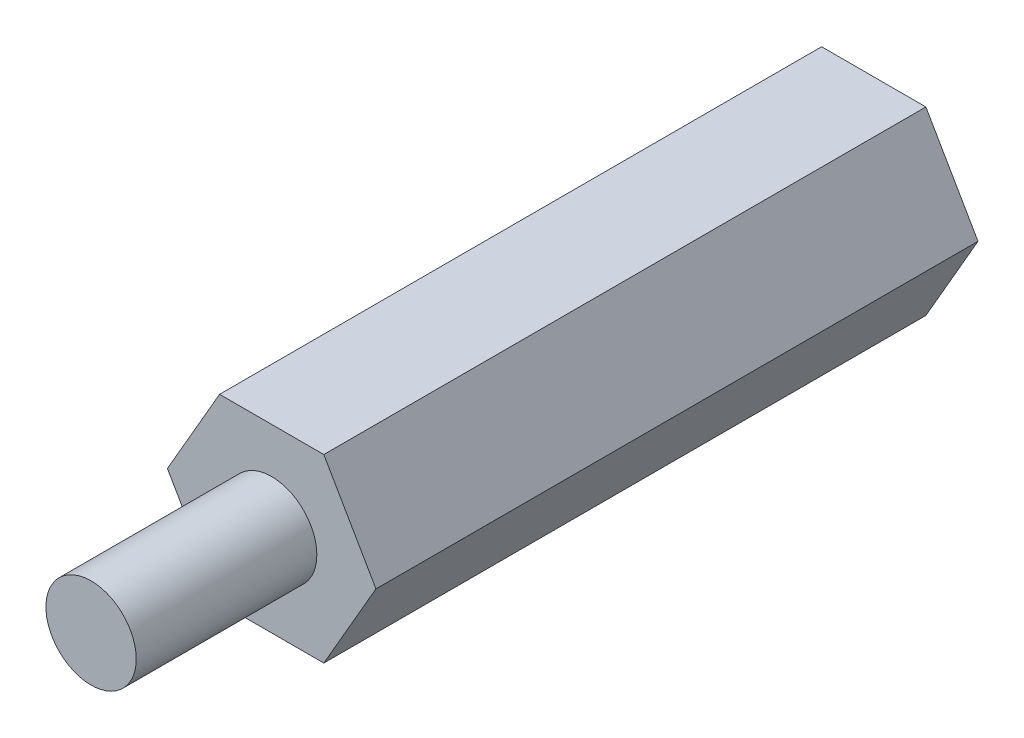
ISO-10303-21;
HEADER;
FILE_DESCRIPTION(('STEP AP214'),'2;1');
FILE_NAME('part.step','',(''),(''),'','','');
FILE_SCHEMA(('AUTOMOTIVE_DESIGN { 1 0 10303 214 1 1 1 1 }'));
ENDSEC;
DATA;
#1=APPLICATION_CONTEXT('core data for automotive mechanical design processes');
#2=APPLICATION_PROTOCOL_DEFINITION('international standard','automotive_design',2000,#1);
#3=PRODUCT_CONTEXT('',#1,'mechanical');
#4=PRODUCT('Part','Part','',(#3));
#5=PRODUCT_RELATED_PRODUCT_CATEGORY('part','',(#4));
#6=PRODUCT_DEFINITION_FORMATION('','',#4);
#7=PRODUCT_DEFINITION_CONTEXT('part definition',#1,'design');
#8=PRODUCT_DEFINITION('design','',#6,#7);
#9=PRODUCT_DEFINITION_SHAPE('','',#8);
#10=(LENGTH_UNIT() NAMED_UNIT(*) SI_UNIT(.MILLI.,.METRE.));
#11=(NAMED_UNIT(*) PLANE_ANGLE_UNIT() SI_UNIT($,.RADIAN.));
#12=(NAMED_UNIT(*) SI_UNIT($,.STERADIAN.) SOLID_ANGLE_UNIT());
#13=UNCERTAINTY_MEASURE_WITH_UNIT(LENGTH_MEASURE(1.E-05),#10,'distance_accuracy_value','');
#14=(GEOMETRIC_REPRESENTATION_CONTEXT(3) GLOBAL_UNCERTAINTY_ASSIGNED_CONTEXT((#13)) GLOBAL_UNIT_ASSIGNED_CONTEXT((#10,
#11,#12)) REPRESENTATION_CONTEXT('',''));
#15=CARTESIAN_POINT('',(0.,0.,0.));
#16=DIRECTION('',(0.,0.,1.));
#17=DIRECTION('',(1.,0.,0.));
#18=AXIS2_PLACEMENT_3D('',#15,#16,#17);
#19=CARTESIAN_POINT('',(0.,0.,20.));
#20=DIRECTION('',(0.,0.,1.));
#21=DIRECTION('',(1.,0.,0.));
#22=AXIS2_PLACEMENT_3D('',#19,#20,#21);
#23=PLANE('',#22);
#24=DIRECTION('',(-0.5,-0.866025403784439,0.));
#25=VECTOR('',#24,1.);
#26=CARTESIAN_POINT('',(-1.73205080756888,3.,20.));
#27=LINE('',#26,#25);
#28=CARTESIAN_POINT('',(-1.73205080756888,3.,20.));
#29=VERTEX_POINT('',#28);
#30=CARTESIAN_POINT('',(-3.46410161513775,0.,20.));
#31=VERTEX_POINT('',#30);
#32=EDGE_CURVE('E132',#29,#31,#27,.T.);
#33=ORIENTED_EDGE('',*,*,#32,.T.);
#34=DIRECTION('',(0.5,-0.866025403784439,0.));
#35=VECTOR('',#34,1.);
#36=CARTESIAN_POINT('',(-3.46410161513775,0.,20.));
#37=LINE('',#36,#35);
#38=CARTESIAN_POINT('',(-1.73205080756888,-3.,20.));
#39=VERTEX_POINT('',#38);
#40=EDGE_CURVE('E89',#31,#39,#37,.T.);
#41=ORIENTED_EDGE('',*,*,#40,.T.);
#42=DIRECTION('',(1.,0.,0.));
#43=VECTOR('',#42,1.);
#44=CARTESIAN_POINT('',(-1.73205080756888,-3.,20.));
#45=LINE('',#44,#43);
#46=CARTESIAN_POINT('',(1.73205080756887,-3.,20.));
#47=VERTEX_POINT('',#46);
#48=EDGE_CURVE('E103',#39,#47,#45,.T.);
#49=ORIENTED_EDGE('',*,*,#48,.T.);
#50=DIRECTION('',(0.499999999999999,0.866025403784439,0.));
#51=VECTOR('',#50,1.);
#52=CARTESIAN_POINT('',(1.73205080756887,-3.,20.));
#53=LINE('',#52,#51);
#54=CARTESIAN_POINT('',(3.46410161513775,0.,20.));
#55=VERTEX_POINT('',#54);
#56=EDGE_CURVE('E97',#47,#55,#53,.T.);
#57=ORIENTED_EDGE('',*,*,#56,.T.);
#58=DIRECTION('',(-0.5,0.866025403784439,0.));
#59=VECTOR('',#58,1.);
#60=CARTESIAN_POINT('',(3.46410161513775,0.,20.));
#61=LINE('',#60,#59);
#62=CARTESIAN_POINT('',(1.73205080756888,3.,20.));
#63=VERTEX_POINT('',#62);
#64=EDGE_CURVE('E101',#55,#63,#61,.T.);
#65=ORIENTED_EDGE('',*,*,#64,.T.);
#66=DIRECTION('',(-1.,0.,0.));
#67=VECTOR('',#66,1.);
#68=CARTESIAN_POINT('',(1.73205080756888,3.,20.));
#69=LINE('',#68,#67);
#70=EDGE_CURVE('E51',#63,#29,#69,.T.);
#71=ORIENTED_EDGE('',*,*,#70,.T.);
#72=EDGE_LOOP('',(#33,#41,#49,#57,#65,#71));
#73=FACE_BOUND('',#72,.T.);
#74=CARTESIAN_POINT('',(0.,0.,20.));
#75=DIRECTION('',(0.,0.,1.));
#76=DIRECTION('',(1.,0.,0.));
#77=AXIS2_PLACEMENT_3D('',#74,#75,#76);
#78=CIRCLE('',#77,1.5);
#79=CARTESIAN_POINT('',(1.5,0.,20.));
#80=VERTEX_POINT('',#79);
#81=EDGE_CURVE('E187',#80,#80,#78,.T.);
#82=ORIENTED_EDGE('',*,*,#81,.F.);
#83=EDGE_LOOP('',(#82));
#84=FACE_BOUND('',#83,.T.);
#85=ADVANCED_FACE('F34',(#73,#84),#23,.T.);
#86=CARTESIAN_POINT('',(-1.73205080756888,3.,20.));
#87=DIRECTION('',(0.866025403784439,-0.5,0.));
#88=DIRECTION('',(0.5,0.866025403784439,0.));
#89=AXIS2_PLACEMENT_3D('',#86,#87,#88);
#90=PLANE('',#89);
#91=DIRECTION('',(-0.5,-0.866025403784439,0.));
#92=VECTOR('',#91,1.);
#93=CARTESIAN_POINT('',(-1.73205080756888,3.,0.));
#94=LINE('',#93,#92);
#95=CARTESIAN_POINT('',(-1.73205080756888,3.,0.));
#96=VERTEX_POINT('',#95);
#97=CARTESIAN_POINT('',(-3.46410161513775,0.,0.));
#98=VERTEX_POINT('',#97);
#99=EDGE_CURVE('E121',#96,#98,#94,.T.);
#100=ORIENTED_EDGE('',*,*,#99,.T.);
#101=DIRECTION('',(0.,0.,-1.));
#102=VECTOR('',#101,1.);
#103=CARTESIAN_POINT('',(-3.46410161513775,0.,20.));
#104=LINE('',#103,#102);
#105=EDGE_CURVE('E11',#31,#98,#104,.T.);
#106=ORIENTED_EDGE('',*,*,#105,.F.);
#107=ORIENTED_EDGE('',*,*,#32,.F.);
#108=DIRECTION('',(0.,0.,-1.));
#109=VECTOR('',#108,1.);
#110=CARTESIAN_POINT('',(-1.73205080756888,3.,20.));
#111=LINE('',#110,#109);
#112=EDGE_CURVE('E117',#29,#96,#111,.T.);
#113=ORIENTED_EDGE('',*,*,#112,.T.);
#114=EDGE_LOOP('',(#100,#106,#107,#113));
#115=FACE_BOUND('',#114,.T.);
#116=ADVANCED_FACE('F36',(#115),#90,.F.);
#117=CARTESIAN_POINT('',(-3.46410161513775,0.,20.));
#118=DIRECTION('',(0.866025403784439,0.5,0.));
#119=DIRECTION('',(-0.5,0.866025403784439,0.));
#120=AXIS2_PLACEMENT_3D('',#117,#118,#119);
#121=PLANE('',#120);
#122=DIRECTION('',(0.5,-0.866025403784439,0.));
#123=VECTOR('',#122,1.);
#124=CARTESIAN_POINT('',(-3.46410161513775,0.,0.));
#125=LINE('',#124,#123);
#126=CARTESIAN_POINT('',(-1.73205080756888,-3.,0.));
#127=VERTEX_POINT('',#126);
#128=EDGE_CURVE('E124',#98,#127,#125,.T.);
#129=ORIENTED_EDGE('',*,*,#128,.T.);
#130=DIRECTION('',(0.,0.,-1.));
#131=VECTOR('',#130,1.);
#132=CARTESIAN_POINT('',(-1.73205080756888,-3.,20.));
#133=LINE('',#132,#131);
#134=EDGE_CURVE('E43',#39,#127,#133,.T.);
#135=ORIENTED_EDGE('',*,*,#134,.F.);
#136=ORIENTED_EDGE('',*,*,#40,.F.);
#137=ORIENTED_EDGE('',*,*,#105,.T.);
#138=EDGE_LOOP('',(#129,#135,#136,#137));
#139=FACE_BOUND('',#138,.T.);
#140=ADVANCED_FACE('F161',(#139),#121,.F.);
#141=CARTESIAN_POINT('',(-1.73205080756888,-3.,20.));
#142=DIRECTION('',(0.,1.,0.));
#143=DIRECTION('',(-1.,0.,0.));
#144=AXIS2_PLACEMENT_3D('',#141,#142,#143);
#145=PLANE('',#144);
#146=DIRECTION('',(1.,0.,0.));
#147=VECTOR('',#146,1.);
#148=CARTESIAN_POINT('',(-1.73205080756888,-3.,0.));
#149=LINE('',#148,#147);
#150=CARTESIAN_POINT('',(1.73205080756887,-3.,0.));
#151=VERTEX_POINT('',#150);
#152=EDGE_CURVE('E127',#127,#151,#149,.T.);
#153=ORIENTED_EDGE('',*,*,#152,.T.);
#154=DIRECTION('',(0.,0.,-1.));
#155=VECTOR('',#154,1.);
#156=CARTESIAN_POINT('',(1.73205080756887,-3.,20.));
#157=LINE('',#156,#155);
#158=EDGE_CURVE('E112',#47,#151,#157,.T.);
#159=ORIENTED_EDGE('',*,*,#158,.F.);
#160=ORIENTED_EDGE('',*,*,#48,.F.);
#161=ORIENTED_EDGE('',*,*,#134,.T.);
#162=EDGE_LOOP('',(#153,#159,#160,#161));
#163=FACE_BOUND('',#162,.T.);
#164=ADVANCED_FACE('F138',(#163),#145,.F.);
#165=CARTESIAN_POINT('',(1.73205080756887,-3.,20.));
#166=DIRECTION('',(-0.866025403784439,0.499999999999999,0.));
#167=DIRECTION('',(-0.499999999999999,-0.866025403784439,0.));
#168=AXIS2_PLACEMENT_3D('',#165,#166,#167);
#169=PLANE('',#168);
#170=DIRECTION('',(0.499999999999999,0.866025403784439,0.));
#171=VECTOR('',#170,1.);
#172=CARTESIAN_POINT('',(1.73205080756887,-3.,0.));
#173=LINE('',#172,#171);
#174=CARTESIAN_POINT('',(3.46410161513775,0.,0.));
#175=VERTEX_POINT('',#174);
#176=EDGE_CURVE('E111',#151,#175,#173,.T.);
#177=ORIENTED_EDGE('',*,*,#176,.T.);
#178=DIRECTION('',(0.,0.,-1.));
#179=VECTOR('',#178,1.);
#180=CARTESIAN_POINT('',(3.46410161513775,0.,20.));
#181=LINE('',#180,#179);
#182=EDGE_CURVE('E108',#55,#175,#181,.T.);
#183=ORIENTED_EDGE('',*,*,#182,.F.);
#184=ORIENTED_EDGE('',*,*,#56,.F.);
#185=ORIENTED_EDGE('',*,*,#158,.T.);
#186=EDGE_LOOP('',(#177,#183,#184,#185));
#187=FACE_BOUND('',#186,.T.);
#188=ADVANCED_FACE('F109',(#187),#169,.F.);
#189=CARTESIAN_POINT('',(3.46410161513775,0.,20.));
#190=DIRECTION('',(-0.866025403784439,-0.5,0.));
#191=DIRECTION('',(0.5,-0.866025403784439,0.));
#192=AXIS2_PLACEMENT_3D('',#189,#190,#191);
#193=PLANE('',#192);
#194=DIRECTION('',(-0.5,0.866025403784439,0.));
#195=VECTOR('',#194,1.);
#196=CARTESIAN_POINT('',(3.46410161513775,0.,0.));
#197=LINE('',#196,#195);
#198=CARTESIAN_POINT('',(1.73205080756888,3.,0.));
#199=VERTEX_POINT('',#198);
#200=EDGE_CURVE('E75',#175,#199,#197,.T.);
#201=ORIENTED_EDGE('',*,*,#200,.T.);
#202=DIRECTION('',(0.,0.,-1.));
#203=VECTOR('',#202,1.);
#204=CARTESIAN_POINT('',(1.73205080756888,3.,20.));
#205=LINE('',#204,#203);
#206=EDGE_CURVE('E113',#63,#199,#205,.T.);
#207=ORIENTED_EDGE('',*,*,#206,.F.);
#208=ORIENTED_EDGE('',*,*,#64,.F.);
#209=ORIENTED_EDGE('',*,*,#182,.T.);
#210=EDGE_LOOP('',(#201,#207,#208,#209));
#211=FACE_BOUND('',#210,.T.);
#212=ADVANCED_FACE('F115',(#211),#193,.F.);
#213=CARTESIAN_POINT('',(1.73205080756888,3.,20.));
#214=DIRECTION('',(0.,-1.,0.));
#215=DIRECTION('',(0.,0.,-1.));
#216=AXIS2_PLACEMENT_3D('',#213,#214,#215);
#217=PLANE('',#216);
#218=DIRECTION('',(-1.,0.,0.));
#219=VECTOR('',#218,1.);
#220=CARTESIAN_POINT('',(1.73205080756888,3.,0.));
#221=LINE('',#220,#219);
#222=EDGE_CURVE('E81',#199,#96,#221,.T.);
#223=ORIENTED_EDGE('',*,*,#222,.T.);
#224=ORIENTED_EDGE('',*,*,#112,.F.);
#225=ORIENTED_EDGE('',*,*,#70,.F.);
#226=ORIENTED_EDGE('',*,*,#206,.T.);
#227=EDGE_LOOP('',(#223,#224,#225,#226));
#228=FACE_BOUND('',#227,.T.);
#229=ADVANCED_FACE('F145',(#228),#217,.F.);
#230=CARTESIAN_POINT('',(0.,0.,0.));
#231=DIRECTION('',(0.,0.,1.));
#232=DIRECTION('',(1.,0.,0.));
#233=AXIS2_PLACEMENT_3D('',#230,#231,#232);
#234=PLANE('',#233);
#235=CARTESIAN_POINT('',(0.,0.,0.));
#236=DIRECTION('',(0.,0.,-1.));
#237=DIRECTION('',(-1.,0.,0.));
#238=AXIS2_PLACEMENT_3D('',#235,#236,#237);
#239=CIRCLE('',#238,1.24999999999999);
#240=CARTESIAN_POINT('',(-1.24999999999999,0.,0.));
#241=VERTEX_POINT('',#240);
#242=EDGE_CURVE('E185',#241,#241,#239,.T.);
#243=ORIENTED_EDGE('',*,*,#242,.F.);
#244=EDGE_LOOP('',(#243));
#245=FACE_BOUND('',#244,.T.);
#246=ORIENTED_EDGE('',*,*,#99,.F.);
#247=ORIENTED_EDGE('',*,*,#222,.F.);
#248=ORIENTED_EDGE('',*,*,#200,.F.);
#249=ORIENTED_EDGE('',*,*,#176,.F.);
#250=ORIENTED_EDGE('',*,*,#152,.F.);
#251=ORIENTED_EDGE('',*,*,#128,.F.);
#252=EDGE_LOOP('',(#246,#247,#248,#249,#250,#251));
#253=FACE_BOUND('',#252,.T.);
#254=ADVANCED_FACE('F141',(#245,#253),#234,.F.);
#255=CARTESIAN_POINT('',(0.,0.,26.));
#256=DIRECTION('',(0.,0.,-1.));
#257=DIRECTION('',(-1.,0.,0.));
#258=AXIS2_PLACEMENT_3D('',#255,#256,#257);
#259=CYLINDRICAL_SURFACE('',#258,1.5);
#260=CARTESIAN_POINT('',(0.,0.,26.));
#261=DIRECTION('',(0.,0.,1.));
#262=DIRECTION('',(1.,0.,0.));
#263=AXIS2_PLACEMENT_3D('',#260,#261,#262);
#264=CIRCLE('',#263,1.5);
#265=CARTESIAN_POINT('',(1.5,0.,26.));
#266=VERTEX_POINT('',#265);
#267=EDGE_CURVE('E125',#266,#266,#264,.T.);
#268=ORIENTED_EDGE('',*,*,#267,.F.);
#269=EDGE_LOOP('',(#268));
#270=FACE_BOUND('',#269,.T.);
#271=ORIENTED_EDGE('',*,*,#81,.T.);
#272=EDGE_LOOP('',(#271));
#273=FACE_BOUND('',#272,.T.);
#274=ADVANCED_FACE('F152',(#270,#273),#259,.T.);
#275=CARTESIAN_POINT('',(0.,0.,26.));
#276=DIRECTION('',(0.,0.,1.));
#277=DIRECTION('',(1.,0.,0.));
#278=AXIS2_PLACEMENT_3D('',#275,#276,#277);
#279=PLANE('',#278);
#280=ORIENTED_EDGE('',*,*,#267,.T.);
#281=EDGE_LOOP('',(#280));
#282=FACE_BOUND('',#281,.T.);
#283=ADVANCED_FACE('F165',(#282),#279,.T.);
#284=CARTESIAN_POINT('',(0.,0.,6.));
#285=DIRECTION('',(0.,0.,-1.));
#286=DIRECTION('',(-1.,0.,0.));
#287=AXIS2_PLACEMENT_3D('',#284,#285,#286);
#288=CONICAL_SURFACE('',#287,1.25,1.02974425867665);
#289=CARTESIAN_POINT('',(0.,0.,6.75107577378445));
#290=VERTEX_POINT('',#289);
#291=VERTEX_LOOP('',#290);
#292=FACE_BOUND('',#291,.T.);
#293=CARTESIAN_POINT('',(0.,0.,6.));
#294=DIRECTION('',(0.,0.,-1.));
#295=DIRECTION('',(-1.,0.,0.));
#296=AXIS2_PLACEMENT_3D('',#293,#294,#295);
#297=CIRCLE('',#296,1.25);
#298=CARTESIAN_POINT('',(-1.25,0.,6.));
#299=VERTEX_POINT('',#298);
#300=EDGE_CURVE('E182',#299,#299,#297,.T.);
#301=ORIENTED_EDGE('',*,*,#300,.T.);
#302=EDGE_LOOP('',(#301));
#303=FACE_BOUND('',#302,.T.);
#304=ADVANCED_FACE('F169',(#292,#303),#288,.F.);
#305=CARTESIAN_POINT('',(0.,0.,0.));
#306=DIRECTION('',(0.,0.,-1.));
#307=DIRECTION('',(-1.,0.,0.));
#308=AXIS2_PLACEMENT_3D('',#305,#306,#307);
#309=CYLINDRICAL_SURFACE('',#308,1.24999999999999);
#310=ORIENTED_EDGE('',*,*,#300,.F.);
#311=EDGE_LOOP('',(#310));
#312=FACE_BOUND('',#311,.T.);
#313=ORIENTED_EDGE('',*,*,#242,.T.);
#314=EDGE_LOOP('',(#313));
#315=FACE_BOUND('',#314,.T.);
#316=ADVANCED_FACE('F173',(#312,#315),#309,.F.);
#317=CLOSED_SHELL('',(#85,#116,#140,#164,#188,#212,#229,#254,#274,#283,#304,#316));
#318=MANIFOLD_SOLID_BREP('B2',#317);
#319=ADVANCED_BREP_SHAPE_REPRESENTATION('',(#18,#318),#14);
#320=SHAPE_DEFINITION_REPRESENTATION(#9,#319);
ENDSEC;
END-ISO-10303-21;
